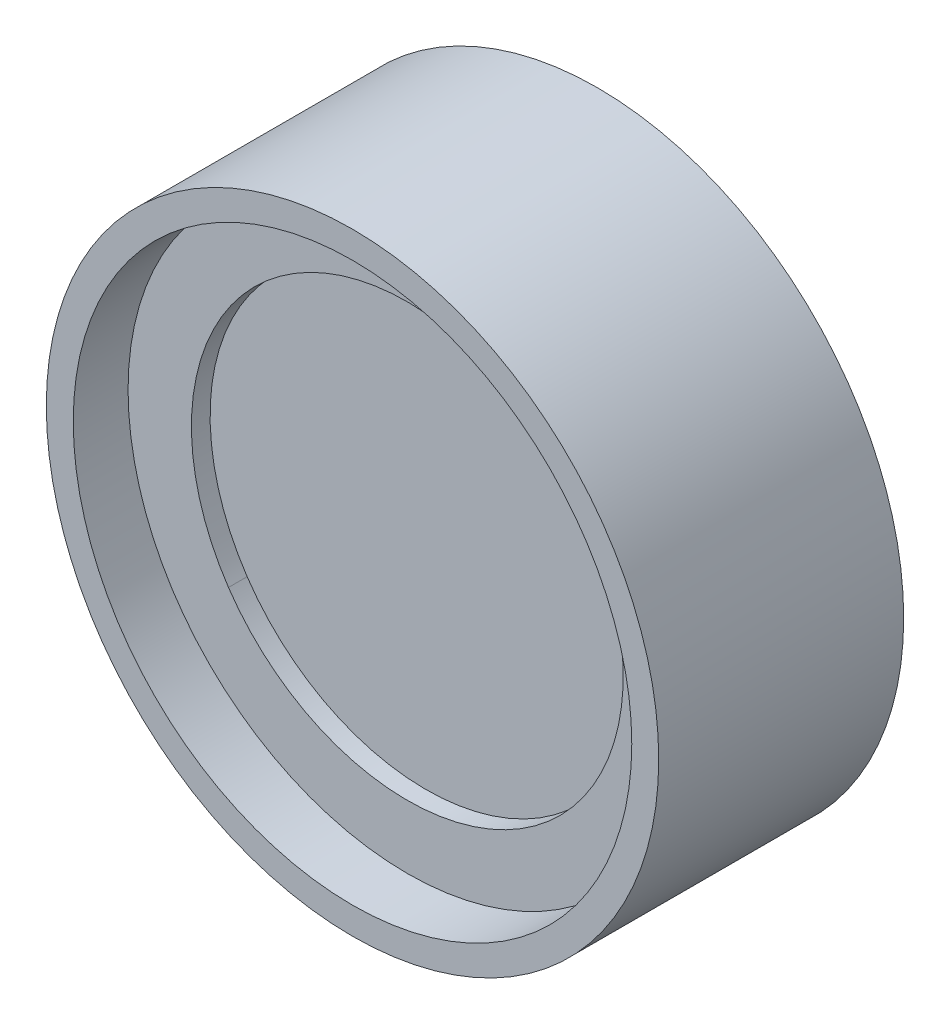
ISO-10303-21;
HEADER;
FILE_DESCRIPTION(('STEP AP214'),'2;1');
FILE_NAME('part.step','',(''),(''),'','','');
FILE_SCHEMA(('AUTOMOTIVE_DESIGN { 1 0 10303 214 1 1 1 1 }'));
ENDSEC;
DATA;
#1=APPLICATION_CONTEXT('core data for automotive mechanical design processes');
#2=APPLICATION_PROTOCOL_DEFINITION('international standard','automotive_design',2000,#1);
#3=PRODUCT_CONTEXT('',#1,'mechanical');
#4=PRODUCT('Part','Part','',(#3));
#5=PRODUCT_RELATED_PRODUCT_CATEGORY('part','',(#4));
#6=PRODUCT_DEFINITION_FORMATION('','',#4);
#7=PRODUCT_DEFINITION_CONTEXT('part definition',#1,'design');
#8=PRODUCT_DEFINITION('design','',#6,#7);
#9=PRODUCT_DEFINITION_SHAPE('','',#8);
#10=(LENGTH_UNIT() NAMED_UNIT(*) SI_UNIT(.MILLI.,.METRE.));
#11=(NAMED_UNIT(*) PLANE_ANGLE_UNIT() SI_UNIT($,.RADIAN.));
#12=(NAMED_UNIT(*) SI_UNIT($,.STERADIAN.) SOLID_ANGLE_UNIT());
#13=UNCERTAINTY_MEASURE_WITH_UNIT(LENGTH_MEASURE(1.E-05),#10,'distance_accuracy_value','');
#14=(GEOMETRIC_REPRESENTATION_CONTEXT(3) GLOBAL_UNCERTAINTY_ASSIGNED_CONTEXT((#13)) GLOBAL_UNIT_ASSIGNED_CONTEXT((#10,
#11,#12)) REPRESENTATION_CONTEXT('',''));
#15=CARTESIAN_POINT('',(0.,0.,0.));
#16=DIRECTION('',(0.,0.,1.));
#17=DIRECTION('',(1.,0.,0.));
#18=AXIS2_PLACEMENT_3D('',#15,#16,#17);
#19=CARTESIAN_POINT('',(-6.,0.,0.381));
#20=DIRECTION('',(0.,0.,1.));
#21=DIRECTION('',(1.,0.,0.));
#22=AXIS2_PLACEMENT_3D('',#19,#20,#21);
#23=PLANE('',#22);
#24=CARTESIAN_POINT('',(0.,0.,0.381));
#25=DIRECTION('',(0.,0.,-1.));
#26=DIRECTION('',(-1.,0.,0.));
#27=AXIS2_PLACEMENT_3D('',#24,#25,#26);
#28=CIRCLE('',#27,5.2);
#29=CARTESIAN_POINT('',(-5.2,0.,0.381));
#30=VERTEX_POINT('',#29);
#31=EDGE_CURVE('P0_E10',#30,#30,#28,.T.);
#32=ORIENTED_EDGE('',*,*,#31,.T.);
#33=EDGE_LOOP('',(#32));
#34=FACE_BOUND('',#33,.T.);
#35=CARTESIAN_POINT('',(0.,0.,0.381));
#36=DIRECTION('',(0.,0.,-1.));
#37=DIRECTION('',(-1.,0.,0.));
#38=AXIS2_PLACEMENT_3D('',#35,#36,#37);
#39=CIRCLE('',#38,6.);
#40=CARTESIAN_POINT('',(-6.,0.,0.381));
#41=VERTEX_POINT('',#40);
#42=EDGE_CURVE('P0_E63',#41,#41,#39,.T.);
#43=ORIENTED_EDGE('',*,*,#42,.F.);
#44=EDGE_LOOP('',(#43));
#45=FACE_BOUND('',#44,.T.);
#46=ADVANCED_FACE('P0_F35',(#34,#45),#23,.T.);
#47=CARTESIAN_POINT('',(0.,0.,-1.69506508729034));
#48=DIRECTION('',(0.,0.,-1.));
#49=DIRECTION('',(-1.,0.,0.));
#50=AXIS2_PLACEMENT_3D('',#47,#48,#49);
#51=CYLINDRICAL_SURFACE('',#50,5.2);
#52=CARTESIAN_POINT('',(0.,0.,-1.119));
#53=DIRECTION('',(0.,0.,-1.));
#54=DIRECTION('',(-1.,0.,0.));
#55=AXIS2_PLACEMENT_3D('',#52,#53,#54);
#56=CIRCLE('',#55,5.2);
#57=CARTESIAN_POINT('',(-5.2,0.,-1.119));
#58=VERTEX_POINT('',#57);
#59=EDGE_CURVE('P0_E41',#58,#58,#56,.T.);
#60=ORIENTED_EDGE('',*,*,#59,.T.);
#61=EDGE_LOOP('',(#60));
#62=FACE_BOUND('',#61,.T.);
#63=ORIENTED_EDGE('',*,*,#31,.F.);
#64=EDGE_LOOP('',(#63));
#65=FACE_BOUND('',#64,.T.);
#66=ADVANCED_FACE('P0_F71',(#62,#65),#51,.F.);
#67=CARTESIAN_POINT('',(-5.2,0.,-1.119));
#68=DIRECTION('',(0.,0.,-1.));
#69=DIRECTION('',(-1.,0.,0.));
#70=AXIS2_PLACEMENT_3D('',#67,#68,#69);
#71=PLANE('',#70);
#72=CARTESIAN_POINT('',(0.,0.,-1.119));
#73=DIRECTION('',(0.,0.,-1.));
#74=DIRECTION('',(-1.,0.,0.));
#75=AXIS2_PLACEMENT_3D('',#72,#73,#74);
#76=CIRCLE('',#75,6.25);
#77=CARTESIAN_POINT('',(-6.25,0.,-1.119));
#78=VERTEX_POINT('',#77);
#79=EDGE_CURVE('P0_E45',#78,#78,#76,.T.);
#80=ORIENTED_EDGE('',*,*,#79,.T.);
#81=EDGE_LOOP('',(#80));
#82=FACE_BOUND('',#81,.T.);
#83=ORIENTED_EDGE('',*,*,#59,.F.);
#84=EDGE_LOOP('',(#83));
#85=FACE_BOUND('',#84,.T.);
#86=ADVANCED_FACE('P0_F75',(#82,#85),#71,.T.);
#87=CARTESIAN_POINT('',(0.,0.,-1.69506508729034));
#88=DIRECTION('',(0.,0.,-1.));
#89=DIRECTION('',(-1.,0.,0.));
#90=AXIS2_PLACEMENT_3D('',#87,#88,#89);
#91=CYLINDRICAL_SURFACE('',#90,6.25);
#92=CARTESIAN_POINT('',(0.,0.,3.881));
#93=DIRECTION('',(0.,0.,-1.));
#94=DIRECTION('',(-1.,0.,0.));
#95=AXIS2_PLACEMENT_3D('',#92,#93,#94);
#96=CIRCLE('',#95,6.25);
#97=CARTESIAN_POINT('',(-6.25,0.,3.881));
#98=VERTEX_POINT('',#97);
#99=EDGE_CURVE('P0_E49',#98,#98,#96,.T.);
#100=ORIENTED_EDGE('',*,*,#99,.T.);
#101=EDGE_LOOP('',(#100));
#102=FACE_BOUND('',#101,.T.);
#103=ORIENTED_EDGE('',*,*,#79,.F.);
#104=EDGE_LOOP('',(#103));
#105=FACE_BOUND('',#104,.T.);
#106=ADVANCED_FACE('P0_F79',(#102,#105),#91,.T.);
#107=CARTESIAN_POINT('',(-6.25,0.,3.881));
#108=DIRECTION('',(0.,0.,1.));
#109=DIRECTION('',(1.,0.,0.));
#110=AXIS2_PLACEMENT_3D('',#107,#108,#109);
#111=PLANE('',#110);
#112=CARTESIAN_POINT('',(0.,0.,3.881));
#113=DIRECTION('',(0.,0.,-1.));
#114=DIRECTION('',(-1.,0.,0.));
#115=AXIS2_PLACEMENT_3D('',#112,#113,#114);
#116=CIRCLE('',#115,5.7);
#117=CARTESIAN_POINT('',(-5.7,0.,3.881));
#118=VERTEX_POINT('',#117);
#119=EDGE_CURVE('P0_E54',#118,#118,#116,.T.);
#120=ORIENTED_EDGE('',*,*,#119,.T.);
#121=EDGE_LOOP('',(#120));
#122=FACE_BOUND('',#121,.T.);
#123=ORIENTED_EDGE('',*,*,#99,.F.);
#124=EDGE_LOOP('',(#123));
#125=FACE_BOUND('',#124,.T.);
#126=ADVANCED_FACE('P0_F86',(#122,#125),#111,.T.);
#127=CARTESIAN_POINT('',(0.,0.,-1.69506508729034));
#128=DIRECTION('',(0.,0.,-1.));
#129=DIRECTION('',(-1.,0.,0.));
#130=AXIS2_PLACEMENT_3D('',#127,#128,#129);
#131=CYLINDRICAL_SURFACE('',#130,5.7);
#132=CARTESIAN_POINT('',(0.,0.,0.881));
#133=DIRECTION('',(0.,0.,-1.));
#134=DIRECTION('',(-1.,0.,0.));
#135=AXIS2_PLACEMENT_3D('',#132,#133,#134);
#136=CIRCLE('',#135,5.7);
#137=CARTESIAN_POINT('',(-5.7,0.,0.881));
#138=VERTEX_POINT('',#137);
#139=EDGE_CURVE('P0_E57',#138,#138,#136,.T.);
#140=ORIENTED_EDGE('',*,*,#139,.T.);
#141=EDGE_LOOP('',(#140));
#142=FACE_BOUND('',#141,.T.);
#143=ORIENTED_EDGE('',*,*,#119,.F.);
#144=EDGE_LOOP('',(#143));
#145=FACE_BOUND('',#144,.T.);
#146=ADVANCED_FACE('P0_F90',(#142,#145),#131,.F.);
#147=CARTESIAN_POINT('',(-5.7,0.,0.881));
#148=DIRECTION('',(0.,0.,-1.));
#149=DIRECTION('',(-1.,0.,0.));
#150=AXIS2_PLACEMENT_3D('',#147,#148,#149);
#151=PLANE('',#150);
#152=CARTESIAN_POINT('',(0.,0.,0.881));
#153=DIRECTION('',(0.,0.,-1.));
#154=DIRECTION('',(-1.,0.,0.));
#155=AXIS2_PLACEMENT_3D('',#152,#153,#154);
#156=CIRCLE('',#155,6.);
#157=CARTESIAN_POINT('',(-6.,0.,0.881));
#158=VERTEX_POINT('',#157);
#159=EDGE_CURVE('P0_E60',#158,#158,#156,.T.);
#160=ORIENTED_EDGE('',*,*,#159,.T.);
#161=EDGE_LOOP('',(#160));
#162=FACE_BOUND('',#161,.T.);
#163=ORIENTED_EDGE('',*,*,#139,.F.);
#164=EDGE_LOOP('',(#163));
#165=FACE_BOUND('',#164,.T.);
#166=ADVANCED_FACE('P0_F94',(#162,#165),#151,.T.);
#167=CARTESIAN_POINT('',(0.,0.,-1.69506508729034));
#168=DIRECTION('',(0.,0.,-1.));
#169=DIRECTION('',(-1.,0.,0.));
#170=AXIS2_PLACEMENT_3D('',#167,#168,#169);
#171=CYLINDRICAL_SURFACE('',#170,6.);
#172=ORIENTED_EDGE('',*,*,#42,.T.);
#173=EDGE_LOOP('',(#172));
#174=FACE_BOUND('',#173,.T.);
#175=ORIENTED_EDGE('',*,*,#159,.F.);
#176=EDGE_LOOP('',(#175));
#177=FACE_BOUND('',#176,.T.);
#178=ADVANCED_FACE('P0_F67',(#174,#177),#171,.F.);
#179=CLOSED_SHELL('',(#46,#66,#86,#106,#126,#146,#166,#178));
#180=MANIFOLD_SOLID_BREP('P0_B2',#179);
#181=CARTESIAN_POINT('',(0.,0.,2.381));
#182=DIRECTION('',(0.,0.,1.));
#183=DIRECTION('',(0.828414208466952,0.560115969429611,0.));
#184=AXIS2_PLACEMENT_3D('',#181,#182,#183);
#185=CYLINDRICAL_SURFACE('',#184,4.4069);
#186=CARTESIAN_POINT('',(0.,0.,2.381));
#187=DIRECTION('',(0.,0.,1.));
#188=DIRECTION('',(0.828414208466952,0.560115969429611,0.));
#189=AXIS2_PLACEMENT_3D('',#186,#187,#188);
#190=CIRCLE('',#189,4.4069);
#191=CARTESIAN_POINT('',(-3.65073857529301,-2.46837506567935,2.381));
#192=VERTEX_POINT('',#191);
#193=CARTESIAN_POINT('',(3.65073857529301,2.46837506567935,2.381));
#194=VERTEX_POINT('',#193);
#195=EDGE_CURVE('P1_E39',#192,#194,#190,.T.);
#196=ORIENTED_EDGE('',*,*,#195,.F.);
#197=DIRECTION('',(0.,0.,1.));
#198=VECTOR('',#197,1.);
#199=CARTESIAN_POINT('',(-3.65073857529301,-2.46837506567935,2.381));
#200=LINE('',#199,#198);
#201=CARTESIAN_POINT('',(-3.65073857529301,-2.46837506567935,2.762));
#202=VERTEX_POINT('',#201);
#203=EDGE_CURVE('P1_E10',#192,#202,#200,.T.);
#204=ORIENTED_EDGE('',*,*,#203,.T.);
#205=CARTESIAN_POINT('',(0.,0.,2.762));
#206=DIRECTION('',(0.,0.,1.));
#207=DIRECTION('',(0.828414208466952,0.560115969429611,0.));
#208=AXIS2_PLACEMENT_3D('',#205,#206,#207);
#209=CIRCLE('',#208,4.4069);
#210=CARTESIAN_POINT('',(3.65073857529301,2.46837506567935,2.762));
#211=VERTEX_POINT('',#210);
#212=EDGE_CURVE('P1_E26',#202,#211,#209,.T.);
#213=ORIENTED_EDGE('',*,*,#212,.T.);
#214=DIRECTION('',(0.,0.,1.));
#215=VECTOR('',#214,1.);
#216=CARTESIAN_POINT('',(3.65073857529301,2.46837506567935,2.381));
#217=LINE('',#216,#215);
#218=EDGE_CURVE('P1_E19',#194,#211,#217,.T.);
#219=ORIENTED_EDGE('',*,*,#218,.F.);
#220=EDGE_LOOP('',(#196,#204,#213,#219));
#221=FACE_BOUND('',#220,.T.);
#222=ADVANCED_FACE('P1_F15',(#221),#185,.F.);
#223=CARTESIAN_POINT('',(0.,0.,2.381));
#224=DIRECTION('',(0.,0.,1.));
#225=DIRECTION('',(0.828414208466952,0.560115969429611,0.));
#226=AXIS2_PLACEMENT_3D('',#223,#224,#225);
#227=CYLINDRICAL_SURFACE('',#226,5.715);
#228=CARTESIAN_POINT('',(0.,0.,2.381));
#229=DIRECTION('',(0.,0.,1.));
#230=DIRECTION('',(0.828414208466952,0.560115969429611,0.));
#231=AXIS2_PLACEMENT_3D('',#228,#229,#230);
#232=CIRCLE('',#231,5.715);
#233=CARTESIAN_POINT('',(4.73438720138863,3.20106276529023,2.381));
#234=VERTEX_POINT('',#233);
#235=CARTESIAN_POINT('',(-4.73438720138863,-3.20106276529023,2.381));
#236=VERTEX_POINT('',#235);
#237=EDGE_CURVE('P1_E77',#234,#236,#232,.T.);
#238=ORIENTED_EDGE('',*,*,#237,.T.);
#239=DIRECTION('',(0.,0.,1.));
#240=VECTOR('',#239,1.);
#241=CARTESIAN_POINT('',(-4.73438720138863,-3.20106276529023,2.381));
#242=LINE('',#241,#240);
#243=CARTESIAN_POINT('',(-4.73438720138863,-3.20106276529023,2.762));
#244=VERTEX_POINT('',#243);
#245=EDGE_CURVE('P1_E90',#236,#244,#242,.T.);
#246=ORIENTED_EDGE('',*,*,#245,.T.);
#247=CARTESIAN_POINT('',(0.,0.,2.762));
#248=DIRECTION('',(0.,0.,1.));
#249=DIRECTION('',(0.828414208466952,0.560115969429611,0.));
#250=AXIS2_PLACEMENT_3D('',#247,#248,#249);
#251=CIRCLE('',#250,5.715);
#252=CARTESIAN_POINT('',(4.73438720138863,3.20106276529023,2.762));
#253=VERTEX_POINT('',#252);
#254=EDGE_CURVE('P1_E68',#253,#244,#251,.T.);
#255=ORIENTED_EDGE('',*,*,#254,.F.);
#256=DIRECTION('',(0.,0.,1.));
#257=VECTOR('',#256,1.);
#258=CARTESIAN_POINT('',(4.73438720138863,3.20106276529023,2.381));
#259=LINE('',#258,#257);
#260=EDGE_CURVE('P1_E74',#234,#253,#259,.T.);
#261=ORIENTED_EDGE('',*,*,#260,.F.);
#262=EDGE_LOOP('',(#238,#246,#255,#261));
#263=FACE_BOUND('',#262,.T.);
#264=ADVANCED_FACE('P1_F76',(#263),#227,.T.);
#265=CARTESIAN_POINT('',(0.,0.,2.381));
#266=DIRECTION('',(0.,0.,1.));
#267=DIRECTION('',(0.828414208466952,0.560115969429611,0.));
#268=AXIS2_PLACEMENT_3D('',#265,#266,#267);
#269=CYLINDRICAL_SURFACE('',#268,5.715);
#270=ORIENTED_EDGE('',*,*,#245,.F.);
#271=CARTESIAN_POINT('',(0.,0.,2.381));
#272=DIRECTION('',(0.,0.,1.));
#273=DIRECTION('',(0.828414208466952,0.560115969429611,0.));
#274=AXIS2_PLACEMENT_3D('',#271,#272,#273);
#275=CIRCLE('',#274,5.715);
#276=EDGE_CURVE('P1_E84',#236,#234,#275,.T.);
#277=ORIENTED_EDGE('',*,*,#276,.T.);
#278=ORIENTED_EDGE('',*,*,#260,.T.);
#279=CARTESIAN_POINT('',(0.,0.,2.762));
#280=DIRECTION('',(0.,0.,1.));
#281=DIRECTION('',(0.828414208466952,0.560115969429611,0.));
#282=AXIS2_PLACEMENT_3D('',#279,#280,#281);
#283=CIRCLE('',#282,5.715);
#284=EDGE_CURVE('P1_E223',#244,#253,#283,.T.);
#285=ORIENTED_EDGE('',*,*,#284,.F.);
#286=EDGE_LOOP('',(#270,#277,#278,#285));
#287=FACE_BOUND('',#286,.T.);
#288=ADVANCED_FACE('P1_F92',(#287),#269,.T.);
#289=CARTESIAN_POINT('',(0.,0.,2.381));
#290=DIRECTION('',(0.,0.,1.));
#291=DIRECTION('',(0.828414208466952,0.560115969429611,0.));
#292=AXIS2_PLACEMENT_3D('',#289,#290,#291);
#293=PLANE('',#292);
#294=ORIENTED_EDGE('',*,*,#237,.F.);
#295=ORIENTED_EDGE('',*,*,#276,.F.);
#296=EDGE_LOOP('',(#294,#295));
#297=FACE_BOUND('',#296,.T.);
#298=CARTESIAN_POINT('',(0.,0.,2.381));
#299=DIRECTION('',(0.,0.,1.));
#300=DIRECTION('',(0.828414208466952,0.560115969429611,0.));
#301=AXIS2_PLACEMENT_3D('',#298,#299,#300);
#302=CIRCLE('',#301,4.4069);
#303=EDGE_CURVE('P1_E85',#194,#192,#302,.T.);
#304=ORIENTED_EDGE('',*,*,#303,.T.);
#305=ORIENTED_EDGE('',*,*,#195,.T.);
#306=EDGE_LOOP('',(#304,#305));
#307=FACE_BOUND('',#306,.T.);
#308=ADVANCED_FACE('P1_F17',(#297,#307),#293,.F.);
#309=CARTESIAN_POINT('',(0.,0.,2.762));
#310=DIRECTION('',(0.,0.,1.));
#311=DIRECTION('',(0.828414208466952,0.560115969429611,0.));
#312=AXIS2_PLACEMENT_3D('',#309,#310,#311);
#313=PLANE('',#312);
#314=ORIENTED_EDGE('',*,*,#254,.T.);
#315=ORIENTED_EDGE('',*,*,#284,.T.);
#316=EDGE_LOOP('',(#314,#315));
#317=FACE_BOUND('',#316,.T.);
#318=CARTESIAN_POINT('',(0.,0.,2.762));
#319=DIRECTION('',(0.,0.,1.));
#320=DIRECTION('',(0.828414208466952,0.560115969429611,0.));
#321=AXIS2_PLACEMENT_3D('',#318,#319,#320);
#322=CIRCLE('',#321,4.4069);
#323=EDGE_CURVE('P1_E106',#211,#202,#322,.T.);
#324=ORIENTED_EDGE('',*,*,#323,.F.);
#325=ORIENTED_EDGE('',*,*,#212,.F.);
#326=EDGE_LOOP('',(#324,#325));
#327=FACE_BOUND('',#326,.T.);
#328=ADVANCED_FACE('P1_F119',(#317,#327),#313,.T.);
#329=CARTESIAN_POINT('',(0.,0.,2.381));
#330=DIRECTION('',(0.,0.,1.));
#331=DIRECTION('',(0.828414208466952,0.560115969429611,0.));
#332=AXIS2_PLACEMENT_3D('',#329,#330,#331);
#333=CYLINDRICAL_SURFACE('',#332,4.4069);
#334=ORIENTED_EDGE('',*,*,#203,.F.);
#335=ORIENTED_EDGE('',*,*,#303,.F.);
#336=ORIENTED_EDGE('',*,*,#218,.T.);
#337=ORIENTED_EDGE('',*,*,#323,.T.);
#338=EDGE_LOOP('',(#334,#335,#336,#337));
#339=FACE_BOUND('',#338,.T.);
#340=ADVANCED_FACE('P1_F116',(#339),#333,.F.);
#341=CLOSED_SHELL('',(#222,#264,#288,#308,#328,#340));
#342=MANIFOLD_SOLID_BREP('P1_B1',#341);
#343=CARTESIAN_POINT('',(0.,0.,2.381));
#344=DIRECTION('',(0.,0.,-1.));
#345=DIRECTION('',(-0.806844709706526,-0.590763585894215,0.));
#346=AXIS2_PLACEMENT_3D('',#343,#344,#345);
#347=CYLINDRICAL_SURFACE('',#346,5.7);
#348=CARTESIAN_POINT('',(0.,0.,2.381));
#349=DIRECTION('',(0.,0.,1.));
#350=DIRECTION('',(0.806844709706526,0.590763585894215,0.));
#351=AXIS2_PLACEMENT_3D('',#348,#349,#350);
#352=CIRCLE('',#351,5.7);
#353=CARTESIAN_POINT('',(4.5990148453272,3.36735243959702,2.381));
#354=VERTEX_POINT('',#353);
#355=CARTESIAN_POINT('',(-4.5990148453272,-3.36735243959702,2.381));
#356=VERTEX_POINT('',#355);
#357=EDGE_CURVE('P2_E46',#354,#356,#352,.T.);
#358=ORIENTED_EDGE('',*,*,#357,.F.);
#359=DIRECTION('',(0.,0.,-1.));
#360=VECTOR('',#359,1.);
#361=CARTESIAN_POINT('',(4.5990148453272,3.36735243959702,2.381));
#362=LINE('',#361,#360);
#363=CARTESIAN_POINT('',(4.5990148453272,3.36735243959702,0.381));
#364=VERTEX_POINT('',#363);
#365=EDGE_CURVE('P2_E13',#354,#364,#362,.T.);
#366=ORIENTED_EDGE('',*,*,#365,.T.);
#367=CARTESIAN_POINT('',(0.,0.,0.381));
#368=DIRECTION('',(0.,0.,1.));
#369=DIRECTION('',(0.806844709706526,0.590763585894215,0.));
#370=AXIS2_PLACEMENT_3D('',#367,#368,#369);
#371=CIRCLE('',#370,5.7);
#372=CARTESIAN_POINT('',(-4.5990148453272,-3.36735243959702,0.381));
#373=VERTEX_POINT('',#372);
#374=EDGE_CURVE('P2_E33',#364,#373,#371,.T.);
#375=ORIENTED_EDGE('',*,*,#374,.T.);
#376=DIRECTION('',(0.,0.,-1.));
#377=VECTOR('',#376,1.);
#378=CARTESIAN_POINT('',(-4.5990148453272,-3.36735243959702,2.381));
#379=LINE('',#378,#377);
#380=EDGE_CURVE('P2_E64',#356,#373,#379,.T.);
#381=ORIENTED_EDGE('',*,*,#380,.F.);
#382=EDGE_LOOP('',(#358,#366,#375,#381));
#383=FACE_BOUND('',#382,.T.);
#384=ADVANCED_FACE('P2_F23',(#383),#347,.T.);
#385=CARTESIAN_POINT('',(0.,0.,2.381));
#386=DIRECTION('',(0.,0.,-1.));
#387=DIRECTION('',(-0.806844709706526,-0.590763585894215,0.));
#388=AXIS2_PLACEMENT_3D('',#385,#386,#387);
#389=CYLINDRICAL_SURFACE('',#388,5.7);
#390=ORIENTED_EDGE('',*,*,#365,.F.);
#391=CARTESIAN_POINT('',(0.,0.,2.381));
#392=DIRECTION('',(0.,0.,1.));
#393=DIRECTION('',(0.806844709706526,0.590763585894215,0.));
#394=AXIS2_PLACEMENT_3D('',#391,#392,#393);
#395=CIRCLE('',#394,5.7);
#396=EDGE_CURVE('P2_E68',#356,#354,#395,.T.);
#397=ORIENTED_EDGE('',*,*,#396,.F.);
#398=ORIENTED_EDGE('',*,*,#380,.T.);
#399=CARTESIAN_POINT('',(0.,0.,0.381));
#400=DIRECTION('',(0.,0.,1.));
#401=DIRECTION('',(0.806844709706526,0.590763585894215,0.));
#402=AXIS2_PLACEMENT_3D('',#399,#400,#401);
#403=CIRCLE('',#402,5.7);
#404=EDGE_CURVE('P2_E26',#373,#364,#403,.T.);
#405=ORIENTED_EDGE('',*,*,#404,.T.);
#406=EDGE_LOOP('',(#390,#397,#398,#405));
#407=FACE_BOUND('',#406,.T.);
#408=ADVANCED_FACE('P2_F66',(#407),#389,.T.);
#409=CARTESIAN_POINT('',(0.,0.,2.381));
#410=DIRECTION('',(0.,0.,1.));
#411=DIRECTION('',(0.806844709706526,0.590763585894215,0.));
#412=AXIS2_PLACEMENT_3D('',#409,#410,#411);
#413=PLANE('',#412);
#414=ORIENTED_EDGE('',*,*,#396,.T.);
#415=ORIENTED_EDGE('',*,*,#357,.T.);
#416=EDGE_LOOP('',(#414,#415));
#417=FACE_BOUND('',#416,.T.);
#418=ADVANCED_FACE('P2_F98',(#417),#413,.T.);
#419=CARTESIAN_POINT('',(0.,0.,0.381));
#420=DIRECTION('',(0.,0.,1.));
#421=DIRECTION('',(0.806844709706526,0.590763585894215,0.));
#422=AXIS2_PLACEMENT_3D('',#419,#420,#421);
#423=PLANE('',#422);
#424=ORIENTED_EDGE('',*,*,#404,.F.);
#425=ORIENTED_EDGE('',*,*,#374,.F.);
#426=EDGE_LOOP('',(#424,#425));
#427=FACE_BOUND('',#426,.T.);
#428=ADVANCED_FACE('P2_F74',(#427),#423,.F.);
#429=CLOSED_SHELL('',(#384,#408,#418,#428));
#430=MANIFOLD_SOLID_BREP('P2_B1',#429);
#431=ADVANCED_BREP_SHAPE_REPRESENTATION('',(#18,#180,#342,#430),#14);
#432=SHAPE_DEFINITION_REPRESENTATION(#9,#431);
ENDSEC;
END-ISO-10303-21;
